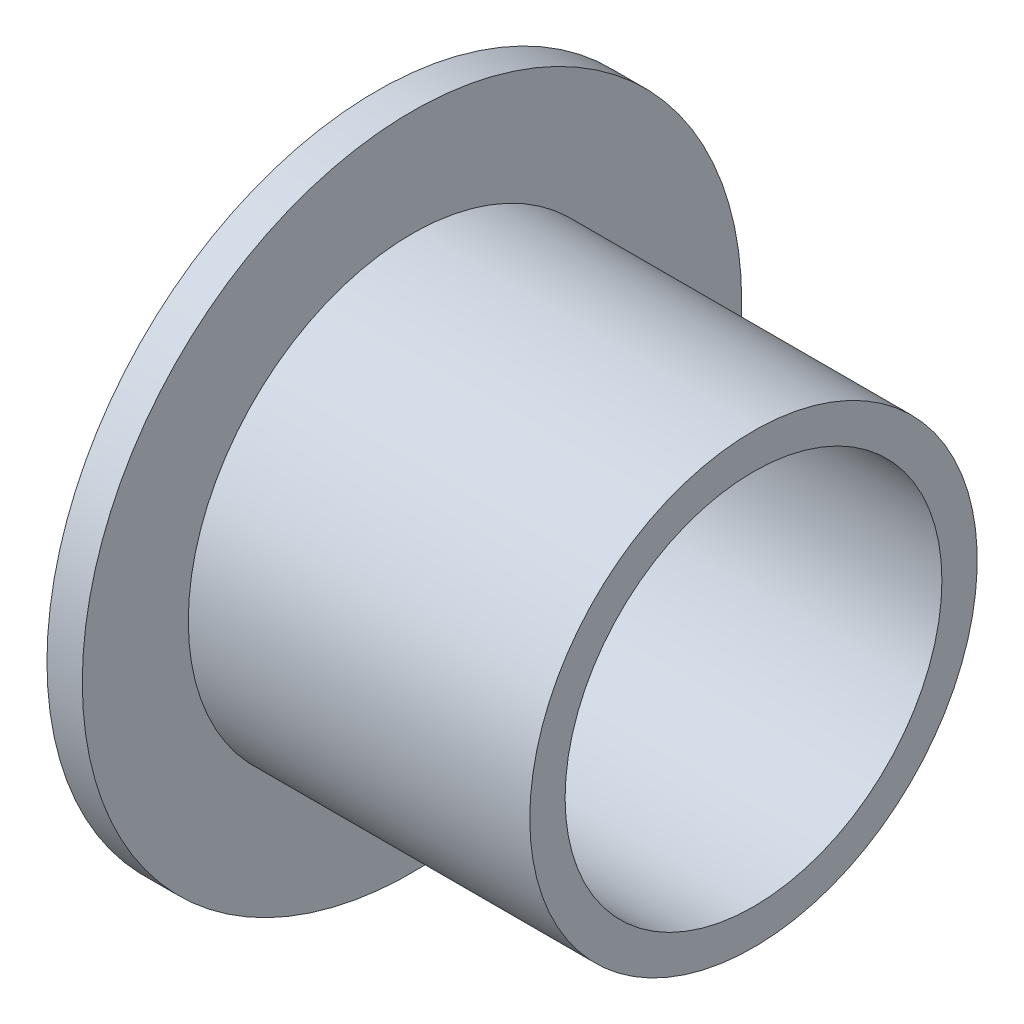
ISO-10303-21;
HEADER;
FILE_DESCRIPTION(('STEP AP214'),'2;1');
FILE_NAME('part.step','',(''),(''),'','','');
FILE_SCHEMA(('AUTOMOTIVE_DESIGN { 1 0 10303 214 1 1 1 1 }'));
ENDSEC;
DATA;
#1=APPLICATION_CONTEXT('core data for automotive mechanical design processes');
#2=APPLICATION_PROTOCOL_DEFINITION('international standard','automotive_design',2000,#1);
#3=PRODUCT_CONTEXT('',#1,'mechanical');
#4=PRODUCT('Part','Part','',(#3));
#5=PRODUCT_RELATED_PRODUCT_CATEGORY('part','',(#4));
#6=PRODUCT_DEFINITION_FORMATION('','',#4);
#7=PRODUCT_DEFINITION_CONTEXT('part definition',#1,'design');
#8=PRODUCT_DEFINITION('design','',#6,#7);
#9=PRODUCT_DEFINITION_SHAPE('','',#8);
#10=(LENGTH_UNIT() NAMED_UNIT(*) SI_UNIT(.MILLI.,.METRE.));
#11=(NAMED_UNIT(*) PLANE_ANGLE_UNIT() SI_UNIT($,.RADIAN.));
#12=(NAMED_UNIT(*) SI_UNIT($,.STERADIAN.) SOLID_ANGLE_UNIT());
#13=UNCERTAINTY_MEASURE_WITH_UNIT(LENGTH_MEASURE(1.E-05),#10,'distance_accuracy_value','');
#14=(GEOMETRIC_REPRESENTATION_CONTEXT(3) GLOBAL_UNCERTAINTY_ASSIGNED_CONTEXT((#13)) GLOBAL_UNIT_ASSIGNED_CONTEXT((#10,
#11,#12)) REPRESENTATION_CONTEXT('',''));
#15=CARTESIAN_POINT('',(0.,0.,0.));
#16=DIRECTION('',(0.,0.,1.));
#17=DIRECTION('',(1.,0.,0.));
#18=AXIS2_PLACEMENT_3D('',#15,#16,#17);
#19=CARTESIAN_POINT('',(0.,0.,0.));
#20=DIRECTION('',(-1.,0.,0.));
#21=DIRECTION('',(0.,0.,1.));
#22=AXIS2_PLACEMENT_3D('',#19,#20,#21);
#23=CYLINDRICAL_SURFACE('',#22,11.1125);
#24=CARTESIAN_POINT('',(-1.190625,0.,0.));
#25=DIRECTION('',(-1.,0.,0.));
#26=DIRECTION('',(0.,0.,1.));
#27=AXIS2_PLACEMENT_3D('',#24,#25,#26);
#28=CIRCLE('',#27,11.1125);
#29=CARTESIAN_POINT('',(-1.190625,0.,11.1125));
#30=VERTEX_POINT('',#29);
#31=EDGE_CURVE('E10',#30,#30,#28,.T.);
#32=ORIENTED_EDGE('',*,*,#31,.F.);
#33=EDGE_LOOP('',(#32));
#34=FACE_BOUND('',#33,.T.);
#35=CARTESIAN_POINT('',(0.,0.,0.));
#36=DIRECTION('',(-1.,0.,0.));
#37=DIRECTION('',(0.,0.,1.));
#38=AXIS2_PLACEMENT_3D('',#35,#36,#37);
#39=CIRCLE('',#38,11.1125);
#40=CARTESIAN_POINT('',(0.,0.,11.1125));
#41=VERTEX_POINT('',#40);
#42=EDGE_CURVE('E52',#41,#41,#39,.T.);
#43=ORIENTED_EDGE('',*,*,#42,.T.);
#44=EDGE_LOOP('',(#43));
#45=FACE_BOUND('',#44,.T.);
#46=ADVANCED_FACE('F30',(#34,#45),#23,.T.);
#47=CARTESIAN_POINT('',(-1.190625,11.1125,0.));
#48=DIRECTION('',(1.,0.,0.));
#49=DIRECTION('',(0.,0.,-1.));
#50=AXIS2_PLACEMENT_3D('',#47,#48,#49);
#51=PLANE('',#50);
#52=CARTESIAN_POINT('',(-1.190625,0.,0.));
#53=DIRECTION('',(-1.,0.,0.));
#54=DIRECTION('',(0.,0.,1.));
#55=AXIS2_PLACEMENT_3D('',#52,#53,#54);
#56=CIRCLE('',#55,6.35);
#57=CARTESIAN_POINT('',(-1.190625,0.,6.35));
#58=VERTEX_POINT('',#57);
#59=EDGE_CURVE('E36',#58,#58,#56,.T.);
#60=ORIENTED_EDGE('',*,*,#59,.F.);
#61=EDGE_LOOP('',(#60));
#62=FACE_BOUND('',#61,.T.);
#63=ORIENTED_EDGE('',*,*,#31,.T.);
#64=EDGE_LOOP('',(#63));
#65=FACE_BOUND('',#64,.T.);
#66=ADVANCED_FACE('F77',(#62,#65),#51,.F.);
#67=CARTESIAN_POINT('',(0.,0.,0.));
#68=DIRECTION('',(-1.,0.,0.));
#69=DIRECTION('',(0.,0.,1.));
#70=AXIS2_PLACEMENT_3D('',#67,#68,#69);
#71=CYLINDRICAL_SURFACE('',#70,6.35);
#72=CARTESIAN_POINT('',(11.509375,0.,0.));
#73=DIRECTION('',(-1.,0.,0.));
#74=DIRECTION('',(0.,0.,1.));
#75=AXIS2_PLACEMENT_3D('',#72,#73,#74);
#76=CIRCLE('',#75,6.35);
#77=CARTESIAN_POINT('',(11.509375,0.,6.35));
#78=VERTEX_POINT('',#77);
#79=EDGE_CURVE('E40',#78,#78,#76,.T.);
#80=ORIENTED_EDGE('',*,*,#79,.F.);
#81=EDGE_LOOP('',(#80));
#82=FACE_BOUND('',#81,.T.);
#83=ORIENTED_EDGE('',*,*,#59,.T.);
#84=EDGE_LOOP('',(#83));
#85=FACE_BOUND('',#84,.T.);
#86=ADVANCED_FACE('F72',(#82,#85),#71,.F.);
#87=CARTESIAN_POINT('',(11.509375,6.35,0.));
#88=DIRECTION('',(-1.,0.,0.));
#89=DIRECTION('',(0.,0.,1.));
#90=AXIS2_PLACEMENT_3D('',#87,#88,#89);
#91=PLANE('',#90);
#92=CARTESIAN_POINT('',(11.509375,0.,0.));
#93=DIRECTION('',(-1.,0.,0.));
#94=DIRECTION('',(0.,0.,1.));
#95=AXIS2_PLACEMENT_3D('',#92,#93,#94);
#96=CIRCLE('',#95,7.540625);
#97=CARTESIAN_POINT('',(11.509375,0.,7.540625));
#98=VERTEX_POINT('',#97);
#99=EDGE_CURVE('E44',#98,#98,#96,.T.);
#100=ORIENTED_EDGE('',*,*,#99,.F.);
#101=EDGE_LOOP('',(#100));
#102=FACE_BOUND('',#101,.T.);
#103=ORIENTED_EDGE('',*,*,#79,.T.);
#104=EDGE_LOOP('',(#103));
#105=FACE_BOUND('',#104,.T.);
#106=ADVANCED_FACE('F66',(#102,#105),#91,.F.);
#107=CARTESIAN_POINT('',(0.,0.,0.));
#108=DIRECTION('',(-1.,0.,0.));
#109=DIRECTION('',(0.,0.,1.));
#110=AXIS2_PLACEMENT_3D('',#107,#108,#109);
#111=CYLINDRICAL_SURFACE('',#110,7.540625);
#112=CARTESIAN_POINT('',(0.,0.,0.));
#113=DIRECTION('',(-1.,0.,0.));
#114=DIRECTION('',(0.,0.,1.));
#115=AXIS2_PLACEMENT_3D('',#112,#113,#114);
#116=CIRCLE('',#115,7.540625);
#117=CARTESIAN_POINT('',(0.,0.,7.540625));
#118=VERTEX_POINT('',#117);
#119=EDGE_CURVE('E49',#118,#118,#116,.T.);
#120=ORIENTED_EDGE('',*,*,#119,.F.);
#121=EDGE_LOOP('',(#120));
#122=FACE_BOUND('',#121,.T.);
#123=ORIENTED_EDGE('',*,*,#99,.T.);
#124=EDGE_LOOP('',(#123));
#125=FACE_BOUND('',#124,.T.);
#126=ADVANCED_FACE('F60',(#122,#125),#111,.T.);
#127=CARTESIAN_POINT('',(0.,7.540625,0.));
#128=DIRECTION('',(-1.,0.,0.));
#129=DIRECTION('',(0.,0.,1.));
#130=AXIS2_PLACEMENT_3D('',#127,#128,#129);
#131=PLANE('',#130);
#132=ORIENTED_EDGE('',*,*,#42,.F.);
#133=EDGE_LOOP('',(#132));
#134=FACE_BOUND('',#133,.T.);
#135=ORIENTED_EDGE('',*,*,#119,.T.);
#136=EDGE_LOOP('',(#135));
#137=FACE_BOUND('',#136,.T.);
#138=ADVANCED_FACE('F57',(#134,#137),#131,.F.);
#139=CLOSED_SHELL('',(#46,#66,#86,#106,#126,#138));
#140=MANIFOLD_SOLID_BREP('B2',#139);
#141=ADVANCED_BREP_SHAPE_REPRESENTATION('',(#18,#140),#14);
#142=SHAPE_DEFINITION_REPRESENTATION(#9,#141);
ENDSEC;
END-ISO-10303-21;
